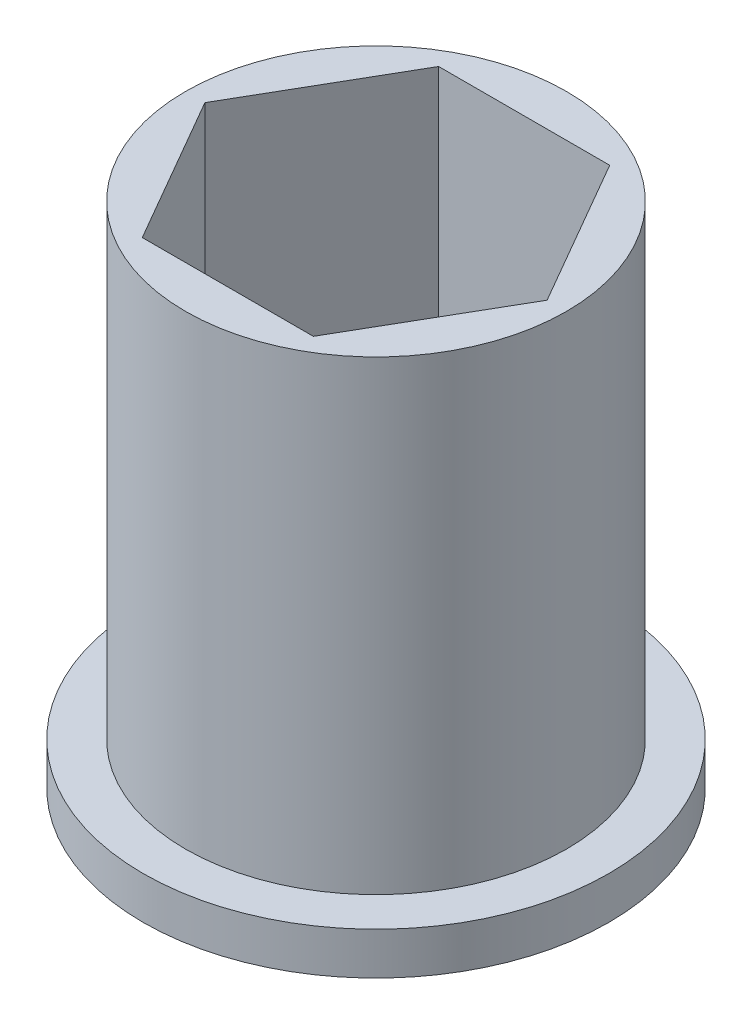
ISO-10303-21;
HEADER;
FILE_DESCRIPTION(('STEP AP214'),'2;1');
FILE_NAME('part.step','',(''),(''),'','','');
FILE_SCHEMA(('AUTOMOTIVE_DESIGN { 1 0 10303 214 1 1 1 1 }'));
ENDSEC;
DATA;
#1=APPLICATION_CONTEXT('core data for automotive mechanical design processes');
#2=APPLICATION_PROTOCOL_DEFINITION('international standard','automotive_design',2000,#1);
#3=PRODUCT_CONTEXT('',#1,'mechanical');
#4=PRODUCT('Part','Part','',(#3));
#5=PRODUCT_RELATED_PRODUCT_CATEGORY('part','',(#4));
#6=PRODUCT_DEFINITION_FORMATION('','',#4);
#7=PRODUCT_DEFINITION_CONTEXT('part definition',#1,'design');
#8=PRODUCT_DEFINITION('design','',#6,#7);
#9=PRODUCT_DEFINITION_SHAPE('','',#8);
#10=(LENGTH_UNIT() NAMED_UNIT(*) SI_UNIT(.MILLI.,.METRE.));
#11=(NAMED_UNIT(*) PLANE_ANGLE_UNIT() SI_UNIT($,.RADIAN.));
#12=(NAMED_UNIT(*) SI_UNIT($,.STERADIAN.) SOLID_ANGLE_UNIT());
#13=UNCERTAINTY_MEASURE_WITH_UNIT(LENGTH_MEASURE(1.E-05),#10,'distance_accuracy_value','');
#14=(GEOMETRIC_REPRESENTATION_CONTEXT(3) GLOBAL_UNCERTAINTY_ASSIGNED_CONTEXT((#13)) GLOBAL_UNIT_ASSIGNED_CONTEXT((#10,
#11,#12)) REPRESENTATION_CONTEXT('',''));
#15=CARTESIAN_POINT('',(0.,0.,0.));
#16=DIRECTION('',(0.,0.,1.));
#17=DIRECTION('',(1.,0.,0.));
#18=AXIS2_PLACEMENT_3D('',#15,#16,#17);
#19=CARTESIAN_POINT('',(0.,12.,0.));
#20=DIRECTION('',(0.,-1.,0.));
#21=DIRECTION('',(0.,0.,-1.));
#22=AXIS2_PLACEMENT_3D('',#19,#20,#21);
#23=CYLINDRICAL_SURFACE('',#22,4.5);
#24=CARTESIAN_POINT('',(0.,12.,0.));
#25=DIRECTION('',(0.,1.,0.));
#26=DIRECTION('',(0.,0.,1.));
#27=AXIS2_PLACEMENT_3D('',#24,#25,#26);
#28=CIRCLE('',#27,4.5);
#29=CARTESIAN_POINT('',(0.,12.,4.5));
#30=VERTEX_POINT('',#29);
#31=EDGE_CURVE('E50',#30,#30,#28,.T.);
#32=ORIENTED_EDGE('',*,*,#31,.F.);
#33=EDGE_LOOP('',(#32));
#34=FACE_BOUND('',#33,.T.);
#35=CARTESIAN_POINT('',(0.,1.,0.));
#36=DIRECTION('',(0.,-1.,0.));
#37=DIRECTION('',(0.,0.,-1.));
#38=AXIS2_PLACEMENT_3D('',#35,#36,#37);
#39=CIRCLE('',#38,4.5);
#40=CARTESIAN_POINT('',(0.,1.,-4.5));
#41=VERTEX_POINT('',#40);
#42=EDGE_CURVE('E11',#41,#41,#39,.T.);
#43=ORIENTED_EDGE('',*,*,#42,.F.);
#44=EDGE_LOOP('',(#43));
#45=FACE_BOUND('',#44,.T.);
#46=ADVANCED_FACE('F43',(#34,#45),#23,.T.);
#47=CARTESIAN_POINT('',(0.,12.,0.));
#48=DIRECTION('',(0.,1.,0.));
#49=DIRECTION('',(0.,0.,1.));
#50=AXIS2_PLACEMENT_3D('',#47,#48,#49);
#51=PLANE('',#50);
#52=ORIENTED_EDGE('',*,*,#31,.T.);
#53=EDGE_LOOP('',(#52));
#54=FACE_BOUND('',#53,.T.);
#55=DIRECTION('',(-0.5,0.,-0.866025403784439));
#56=VECTOR('',#55,1.);
#57=CARTESIAN_POINT('',(4.04145188432738,12.,0.));
#58=LINE('',#57,#56);
#59=CARTESIAN_POINT('',(4.04145188432738,12.,0.));
#60=VERTEX_POINT('',#59);
#61=CARTESIAN_POINT('',(2.02072594216369,12.,-3.5));
#62=VERTEX_POINT('',#61);
#63=EDGE_CURVE('E103',#60,#62,#58,.T.);
#64=ORIENTED_EDGE('',*,*,#63,.F.);
#65=DIRECTION('',(0.5,0.,-0.866025403784439));
#66=VECTOR('',#65,1.);
#67=CARTESIAN_POINT('',(2.02072594216369,12.,3.5));
#68=LINE('',#67,#66);
#69=CARTESIAN_POINT('',(2.02072594216369,12.,3.5));
#70=VERTEX_POINT('',#69);
#71=EDGE_CURVE('E95',#70,#60,#68,.T.);
#72=ORIENTED_EDGE('',*,*,#71,.F.);
#73=DIRECTION('',(1.,0.,0.));
#74=VECTOR('',#73,1.);
#75=CARTESIAN_POINT('',(-2.02072594216369,12.,3.5));
#76=LINE('',#75,#74);
#77=CARTESIAN_POINT('',(-2.02072594216369,12.,3.5));
#78=VERTEX_POINT('',#77);
#79=EDGE_CURVE('E125',#78,#70,#76,.T.);
#80=ORIENTED_EDGE('',*,*,#79,.F.);
#81=DIRECTION('',(0.5,0.,0.866025403784439));
#82=VECTOR('',#81,1.);
#83=CARTESIAN_POINT('',(-4.04145188432738,12.,0.));
#84=LINE('',#83,#82);
#85=CARTESIAN_POINT('',(-4.04145188432738,12.,0.));
#86=VERTEX_POINT('',#85);
#87=EDGE_CURVE('E123',#86,#78,#84,.T.);
#88=ORIENTED_EDGE('',*,*,#87,.F.);
#89=DIRECTION('',(-0.5,0.,0.866025403784439));
#90=VECTOR('',#89,1.);
#91=CARTESIAN_POINT('',(-2.02072594216369,12.,-3.5));
#92=LINE('',#91,#90);
#93=CARTESIAN_POINT('',(-2.02072594216369,12.,-3.5));
#94=VERTEX_POINT('',#93);
#95=EDGE_CURVE('E118',#94,#86,#92,.T.);
#96=ORIENTED_EDGE('',*,*,#95,.F.);
#97=DIRECTION('',(-1.,0.,0.));
#98=VECTOR('',#97,1.);
#99=CARTESIAN_POINT('',(2.02072594216369,12.,-3.5));
#100=LINE('',#99,#98);
#101=EDGE_CURVE('E116',#62,#94,#100,.T.);
#102=ORIENTED_EDGE('',*,*,#101,.F.);
#103=EDGE_LOOP('',(#64,#72,#80,#88,#96,#102));
#104=FACE_BOUND('',#103,.T.);
#105=ADVANCED_FACE('F114',(#54,#104),#51,.T.);
#106=CARTESIAN_POINT('',(0.,0.,0.));
#107=DIRECTION('',(0.,1.,0.));
#108=DIRECTION('',(0.,0.,1.));
#109=AXIS2_PLACEMENT_3D('',#106,#107,#108);
#110=PLANE('',#109);
#111=DIRECTION('',(0.5,0.,-0.866025403784439));
#112=VECTOR('',#111,1.);
#113=CARTESIAN_POINT('',(2.02072594216369,0.,3.5));
#114=LINE('',#113,#112);
#115=CARTESIAN_POINT('',(2.02072594216369,0.,3.5));
#116=VERTEX_POINT('',#115);
#117=CARTESIAN_POINT('',(4.04145188432738,0.,0.));
#118=VERTEX_POINT('',#117);
#119=EDGE_CURVE('E65',#116,#118,#114,.T.);
#120=ORIENTED_EDGE('',*,*,#119,.T.);
#121=DIRECTION('',(-0.5,0.,-0.866025403784439));
#122=VECTOR('',#121,1.);
#123=CARTESIAN_POINT('',(4.04145188432738,0.,0.));
#124=LINE('',#123,#122);
#125=CARTESIAN_POINT('',(2.02072594216369,0.,-3.5));
#126=VERTEX_POINT('',#125);
#127=EDGE_CURVE('E110',#118,#126,#124,.T.);
#128=ORIENTED_EDGE('',*,*,#127,.T.);
#129=DIRECTION('',(-1.,0.,0.));
#130=VECTOR('',#129,1.);
#131=CARTESIAN_POINT('',(2.02072594216369,0.,-3.5));
#132=LINE('',#131,#130);
#133=CARTESIAN_POINT('',(-2.02072594216369,0.,-3.5));
#134=VERTEX_POINT('',#133);
#135=EDGE_CURVE('E130',#126,#134,#132,.T.);
#136=ORIENTED_EDGE('',*,*,#135,.T.);
#137=DIRECTION('',(-0.5,0.,0.866025403784439));
#138=VECTOR('',#137,1.);
#139=CARTESIAN_POINT('',(-2.02072594216369,0.,-3.5));
#140=LINE('',#139,#138);
#141=CARTESIAN_POINT('',(-4.04145188432738,0.,0.));
#142=VERTEX_POINT('',#141);
#143=EDGE_CURVE('E133',#134,#142,#140,.T.);
#144=ORIENTED_EDGE('',*,*,#143,.T.);
#145=DIRECTION('',(0.5,0.,0.866025403784439));
#146=VECTOR('',#145,1.);
#147=CARTESIAN_POINT('',(-4.04145188432738,0.,0.));
#148=LINE('',#147,#146);
#149=CARTESIAN_POINT('',(-2.02072594216369,0.,3.5));
#150=VERTEX_POINT('',#149);
#151=EDGE_CURVE('E136',#142,#150,#148,.T.);
#152=ORIENTED_EDGE('',*,*,#151,.T.);
#153=DIRECTION('',(1.,0.,0.));
#154=VECTOR('',#153,1.);
#155=CARTESIAN_POINT('',(-2.02072594216369,0.,3.5));
#156=LINE('',#155,#154);
#157=EDGE_CURVE('E104',#150,#116,#156,.T.);
#158=ORIENTED_EDGE('',*,*,#157,.T.);
#159=EDGE_LOOP('',(#120,#128,#136,#144,#152,#158));
#160=FACE_BOUND('',#159,.T.);
#161=CARTESIAN_POINT('',(0.,0.,0.));
#162=DIRECTION('',(0.,-1.,0.));
#163=DIRECTION('',(0.,0.,-1.));
#164=AXIS2_PLACEMENT_3D('',#161,#162,#163);
#165=CIRCLE('',#164,5.5);
#166=CARTESIAN_POINT('',(0.,0.,-5.5));
#167=VERTEX_POINT('',#166);
#168=EDGE_CURVE('E163',#167,#167,#165,.T.);
#169=ORIENTED_EDGE('',*,*,#168,.T.);
#170=EDGE_LOOP('',(#169));
#171=FACE_BOUND('',#170,.T.);
#172=ADVANCED_FACE('F168',(#160,#171),#110,.F.);
#173=CARTESIAN_POINT('',(2.02072594216369,12.,3.5));
#174=DIRECTION('',(-0.866025403784439,0.,-0.5));
#175=DIRECTION('',(-0.5,0.,0.866025403784439));
#176=AXIS2_PLACEMENT_3D('',#173,#174,#175);
#177=PLANE('',#176);
#178=ORIENTED_EDGE('',*,*,#119,.F.);
#179=DIRECTION('',(0.,-1.,0.));
#180=VECTOR('',#179,1.);
#181=CARTESIAN_POINT('',(2.02072594216369,12.,3.5));
#182=LINE('',#181,#180);
#183=EDGE_CURVE('E99',#70,#116,#182,.T.);
#184=ORIENTED_EDGE('',*,*,#183,.F.);
#185=ORIENTED_EDGE('',*,*,#71,.T.);
#186=DIRECTION('',(0.,-1.,0.));
#187=VECTOR('',#186,1.);
#188=CARTESIAN_POINT('',(4.04145188432738,12.,0.));
#189=LINE('',#188,#187);
#190=EDGE_CURVE('E98',#60,#118,#189,.T.);
#191=ORIENTED_EDGE('',*,*,#190,.T.);
#192=EDGE_LOOP('',(#178,#184,#185,#191));
#193=FACE_BOUND('',#192,.T.);
#194=ADVANCED_FACE('F97',(#193),#177,.T.);
#195=CARTESIAN_POINT('',(4.04145188432738,12.,0.));
#196=DIRECTION('',(-0.866025403784438,0.,0.5));
#197=DIRECTION('',(0.5,0.,0.866025403784439));
#198=AXIS2_PLACEMENT_3D('',#195,#196,#197);
#199=PLANE('',#198);
#200=ORIENTED_EDGE('',*,*,#127,.F.);
#201=ORIENTED_EDGE('',*,*,#190,.F.);
#202=ORIENTED_EDGE('',*,*,#63,.T.);
#203=DIRECTION('',(0.,-1.,0.));
#204=VECTOR('',#203,1.);
#205=CARTESIAN_POINT('',(2.02072594216369,12.,-3.5));
#206=LINE('',#205,#204);
#207=EDGE_CURVE('E111',#62,#126,#206,.T.);
#208=ORIENTED_EDGE('',*,*,#207,.T.);
#209=EDGE_LOOP('',(#200,#201,#202,#208));
#210=FACE_BOUND('',#209,.T.);
#211=ADVANCED_FACE('F107',(#210),#199,.T.);
#212=CARTESIAN_POINT('',(2.02072594216369,12.,-3.5));
#213=DIRECTION('',(0.,0.,1.));
#214=DIRECTION('',(1.,0.,0.));
#215=AXIS2_PLACEMENT_3D('',#212,#213,#214);
#216=PLANE('',#215);
#217=ORIENTED_EDGE('',*,*,#135,.F.);
#218=ORIENTED_EDGE('',*,*,#207,.F.);
#219=ORIENTED_EDGE('',*,*,#101,.T.);
#220=DIRECTION('',(0.,-1.,0.));
#221=VECTOR('',#220,1.);
#222=CARTESIAN_POINT('',(-2.02072594216369,12.,-3.5));
#223=LINE('',#222,#221);
#224=EDGE_CURVE('E145',#94,#134,#223,.T.);
#225=ORIENTED_EDGE('',*,*,#224,.T.);
#226=EDGE_LOOP('',(#217,#218,#219,#225));
#227=FACE_BOUND('',#226,.T.);
#228=ADVANCED_FACE('F186',(#227),#216,.T.);
#229=CARTESIAN_POINT('',(-2.02072594216369,12.,-3.5));
#230=DIRECTION('',(0.866025403784439,0.,0.5));
#231=DIRECTION('',(0.5,0.,-0.866025403784439));
#232=AXIS2_PLACEMENT_3D('',#229,#230,#231);
#233=PLANE('',#232);
#234=ORIENTED_EDGE('',*,*,#143,.F.);
#235=ORIENTED_EDGE('',*,*,#224,.F.);
#236=ORIENTED_EDGE('',*,*,#95,.T.);
#237=DIRECTION('',(0.,-1.,0.));
#238=VECTOR('',#237,1.);
#239=CARTESIAN_POINT('',(-4.04145188432738,12.,0.));
#240=LINE('',#239,#238);
#241=EDGE_CURVE('E143',#86,#142,#240,.T.);
#242=ORIENTED_EDGE('',*,*,#241,.T.);
#243=EDGE_LOOP('',(#234,#235,#236,#242));
#244=FACE_BOUND('',#243,.T.);
#245=ADVANCED_FACE('F182',(#244),#233,.T.);
#246=CARTESIAN_POINT('',(-4.04145188432738,12.,0.));
#247=DIRECTION('',(0.866025403784439,0.,-0.5));
#248=DIRECTION('',(-0.5,0.,-0.866025403784439));
#249=AXIS2_PLACEMENT_3D('',#246,#247,#248);
#250=PLANE('',#249);
#251=ORIENTED_EDGE('',*,*,#151,.F.);
#252=ORIENTED_EDGE('',*,*,#241,.F.);
#253=ORIENTED_EDGE('',*,*,#87,.T.);
#254=DIRECTION('',(0.,-1.,0.));
#255=VECTOR('',#254,1.);
#256=CARTESIAN_POINT('',(-2.02072594216369,12.,3.5));
#257=LINE('',#256,#255);
#258=EDGE_CURVE('E57',#78,#150,#257,.T.);
#259=ORIENTED_EDGE('',*,*,#258,.T.);
#260=EDGE_LOOP('',(#251,#252,#253,#259));
#261=FACE_BOUND('',#260,.T.);
#262=ADVANCED_FACE('F177',(#261),#250,.T.);
#263=CARTESIAN_POINT('',(-2.02072594216369,12.,3.5));
#264=DIRECTION('',(0.,0.,-1.));
#265=DIRECTION('',(-1.,0.,0.));
#266=AXIS2_PLACEMENT_3D('',#263,#264,#265);
#267=PLANE('',#266);
#268=ORIENTED_EDGE('',*,*,#157,.F.);
#269=ORIENTED_EDGE('',*,*,#258,.F.);
#270=ORIENTED_EDGE('',*,*,#79,.T.);
#271=ORIENTED_EDGE('',*,*,#183,.T.);
#272=EDGE_LOOP('',(#268,#269,#270,#271));
#273=FACE_BOUND('',#272,.T.);
#274=ADVANCED_FACE('F171',(#273),#267,.T.);
#275=CARTESIAN_POINT('',(0.,1.,0.));
#276=DIRECTION('',(0.,-1.,0.));
#277=DIRECTION('',(0.,0.,-1.));
#278=AXIS2_PLACEMENT_3D('',#275,#276,#277);
#279=CYLINDRICAL_SURFACE('',#278,5.5);
#280=CARTESIAN_POINT('',(0.,1.,0.));
#281=DIRECTION('',(0.,-1.,0.));
#282=DIRECTION('',(0.,0.,-1.));
#283=AXIS2_PLACEMENT_3D('',#280,#281,#282);
#284=CIRCLE('',#283,5.5);
#285=CARTESIAN_POINT('',(0.,1.,-5.5));
#286=VERTEX_POINT('',#285);
#287=EDGE_CURVE('E128',#286,#286,#284,.T.);
#288=ORIENTED_EDGE('',*,*,#287,.T.);
#289=EDGE_LOOP('',(#288));
#290=FACE_BOUND('',#289,.T.);
#291=ORIENTED_EDGE('',*,*,#168,.F.);
#292=EDGE_LOOP('',(#291));
#293=FACE_BOUND('',#292,.T.);
#294=ADVANCED_FACE('F158',(#290,#293),#279,.T.);
#295=CARTESIAN_POINT('',(0.,1.,0.));
#296=DIRECTION('',(0.,-1.,0.));
#297=DIRECTION('',(0.,0.,-1.));
#298=AXIS2_PLACEMENT_3D('',#295,#296,#297);
#299=PLANE('',#298);
#300=ORIENTED_EDGE('',*,*,#42,.T.);
#301=EDGE_LOOP('',(#300));
#302=FACE_BOUND('',#301,.T.);
#303=ORIENTED_EDGE('',*,*,#287,.F.);
#304=EDGE_LOOP('',(#303));
#305=FACE_BOUND('',#304,.T.);
#306=ADVANCED_FACE('F155',(#302,#305),#299,.F.);
#307=CLOSED_SHELL('',(#46,#105,#172,#194,#211,#228,#245,#262,#274,#294,#306));
#308=MANIFOLD_SOLID_BREP('B2',#307);
#309=ADVANCED_BREP_SHAPE_REPRESENTATION('',(#18,#308),#14);
#310=SHAPE_DEFINITION_REPRESENTATION(#9,#309);
ENDSEC;
END-ISO-10303-21;
